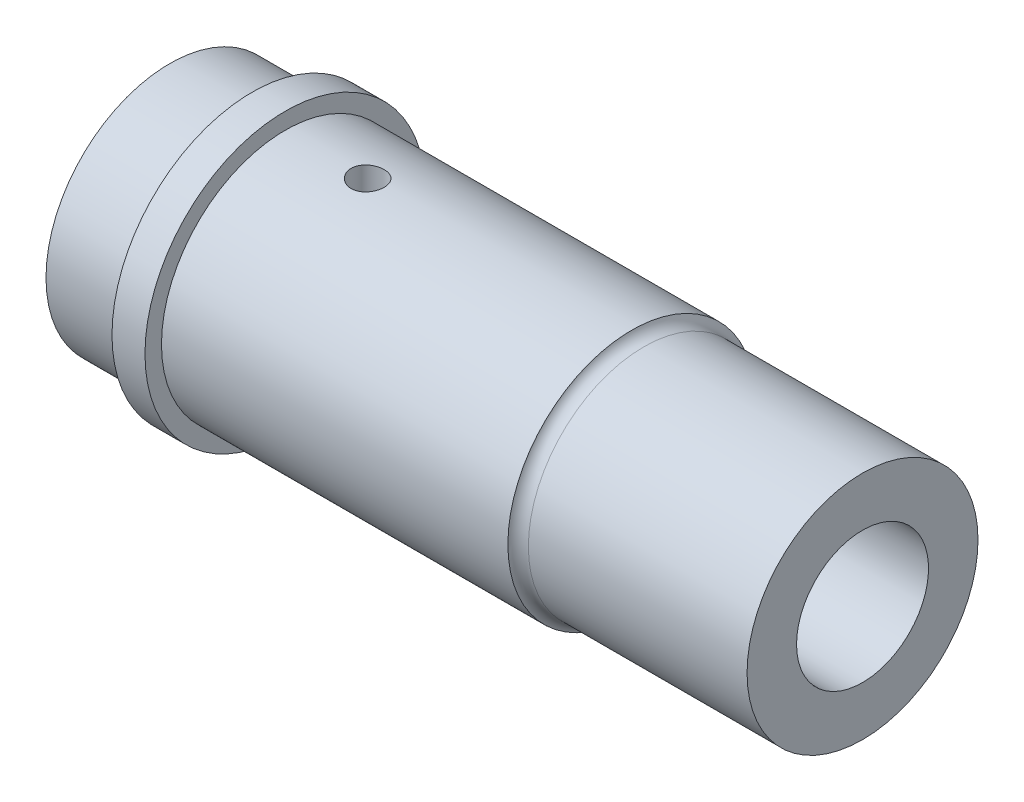
ISO-10303-21;
HEADER;
FILE_DESCRIPTION(('STEP AP214'),'2;1');
FILE_NAME('part.step','',(''),(''),'','','');
FILE_SCHEMA(('AUTOMOTIVE_DESIGN { 1 0 10303 214 1 1 1 1 }'));
ENDSEC;
DATA;
#1=APPLICATION_CONTEXT('core data for automotive mechanical design processes');
#2=APPLICATION_PROTOCOL_DEFINITION('international standard','automotive_design',2000,#1);
#3=PRODUCT_CONTEXT('',#1,'mechanical');
#4=PRODUCT('Part','Part','',(#3));
#5=PRODUCT_RELATED_PRODUCT_CATEGORY('part','',(#4));
#6=PRODUCT_DEFINITION_FORMATION('','',#4);
#7=PRODUCT_DEFINITION_CONTEXT('part definition',#1,'design');
#8=PRODUCT_DEFINITION('design','',#6,#7);
#9=PRODUCT_DEFINITION_SHAPE('','',#8);
#10=(LENGTH_UNIT() NAMED_UNIT(*) SI_UNIT(.MILLI.,.METRE.));
#11=(NAMED_UNIT(*) PLANE_ANGLE_UNIT() SI_UNIT($,.RADIAN.));
#12=(NAMED_UNIT(*) SI_UNIT($,.STERADIAN.) SOLID_ANGLE_UNIT());
#13=UNCERTAINTY_MEASURE_WITH_UNIT(LENGTH_MEASURE(1.E-05),#10,'distance_accuracy_value','');
#14=(GEOMETRIC_REPRESENTATION_CONTEXT(3) GLOBAL_UNCERTAINTY_ASSIGNED_CONTEXT((#13)) GLOBAL_UNIT_ASSIGNED_CONTEXT((#10,
#11,#12)) REPRESENTATION_CONTEXT('',''));
#15=CARTESIAN_POINT('',(0.,0.,0.));
#16=DIRECTION('',(0.,0.,1.));
#17=DIRECTION('',(1.,0.,0.));
#18=AXIS2_PLACEMENT_3D('',#15,#16,#17);
#19=CARTESIAN_POINT('',(42.,0.,0.));
#20=DIRECTION('',(-1.,0.,0.));
#21=DIRECTION('',(0.,0.,1.));
#22=AXIS2_PLACEMENT_3D('',#19,#20,#21);
#23=CYLINDRICAL_SURFACE('',#22,7.5);
#24=CARTESIAN_POINT('',(28.,0.,0.));
#25=DIRECTION('',(1.,0.,0.));
#26=DIRECTION('',(0.,0.,-1.));
#27=AXIS2_PLACEMENT_3D('',#24,#25,#26);
#28=CIRCLE('',#27,7.5);
#29=CARTESIAN_POINT('',(28.,0.,-7.5));
#30=VERTEX_POINT('',#29);
#31=EDGE_CURVE('E188',#30,#30,#28,.T.);
#32=ORIENTED_EDGE('',*,*,#31,.F.);
#33=EDGE_LOOP('',(#32));
#34=FACE_BOUND('',#33,.T.);
#35=CARTESIAN_POINT('',(12.,7.43303437365925,1.));
#36=CARTESIAN_POINT('',(12.0559019277301,7.43303522266631,0.99999764297421));
#37=CARTESIAN_POINT('',(12.1118380165464,7.43367182371829,0.995296633522847));
#38=CARTESIAN_POINT('',(12.222151231157,7.43614824351763,0.976618981332773));
#39=CARTESIAN_POINT('',(12.2765267024564,7.43798929330704,0.962632848245785));
#40=CARTESIAN_POINT('',(12.382105684117,7.44266246058434,0.925806555700512));
#41=CARTESIAN_POINT('',(12.4333114058099,7.4454938777722,0.902972651375005));
#42=CARTESIAN_POINT('',(12.5311555378537,7.45182791129731,0.849112824403647));
#43=CARTESIAN_POINT('',(12.5777946794687,7.45533041990363,0.818088216317403));
#44=CARTESIAN_POINT('',(12.6654867273345,7.46263688659337,0.74851685244753));
#45=CARTESIAN_POINT('',(12.7065064328398,7.4664424424659,0.709928411374281));
#46=CARTESIAN_POINT('',(12.7815081227281,7.47391188129393,0.626414614363067));
#47=CARTESIAN_POINT('',(12.8154897457381,7.47757575696696,0.581488933235995));
#48=CARTESIAN_POINT('',(12.8755709208582,7.48436549880109,0.486365862463802));
#49=CARTESIAN_POINT('',(12.9016402446451,7.48748928251119,0.43614921885561));
#50=CARTESIAN_POINT('',(12.9449630820904,7.49282926707925,0.332001908018684));
#51=CARTESIAN_POINT('',(12.9622169661888,7.49504550607303,0.2780713969612));
#52=CARTESIAN_POINT('',(12.9873194547901,7.49830943097799,0.168367687507043));
#53=CARTESIAN_POINT('',(12.995223407506,7.49936399102537,0.112607361734948));
#54=CARTESIAN_POINT('',(13.0015733043684,7.5002092398576,0.000542501151827599));
#55=CARTESIAN_POINT('',(13.0000196688683,7.49999998481415,-0.0557620093612336));
#56=CARTESIAN_POINT('',(12.9875426347295,7.49834672058453,-0.166940062232885));
#57=CARTESIAN_POINT('',(12.9766787676272,7.49691055668904,-0.221820418680892));
#58=CARTESIAN_POINT('',(12.9459828364892,7.49297362046144,-0.328972061356277));
#59=CARTESIAN_POINT('',(12.9261505824159,7.49047282557017,-0.38124329227092));
#60=CARTESIAN_POINT('',(12.8780182794391,7.48467409502082,-0.481875904212065));
#61=CARTESIAN_POINT('',(12.8496926884085,7.48137376072939,-0.53022492467663));
#62=CARTESIAN_POINT('',(12.7853963713586,7.4743447520952,-0.621505845367393));
#63=CARTESIAN_POINT('',(12.7494252466861,7.47061605542144,-0.664437462933408));
#64=CARTESIAN_POINT('',(12.6705260758205,7.46311294047831,-0.744015030772694));
#65=CARTESIAN_POINT('',(12.6275461159032,7.459338392122,-0.780609516765106));
#66=CARTESIAN_POINT('',(12.5360270343137,7.45219749384619,-0.846073465285956));
#67=CARTESIAN_POINT('',(12.4874878905985,7.44883114554537,-0.874942897181765));
#68=CARTESIAN_POINT('',(12.3861799998266,7.4428878816717,-0.9241414304325));
#69=CARTESIAN_POINT('',(12.3334090477408,7.44031138107393,-0.944466044533533));
#70=CARTESIAN_POINT('',(12.2251609896808,7.43624737732859,-0.97595045022462));
#71=CARTESIAN_POINT('',(12.1696840329867,7.43475981418081,-0.987110746770717));
#72=CARTESIAN_POINT('',(12.0580543324975,7.43305322505173,-0.999880803843635));
#73=CARTESIAN_POINT('',(12.0019100348337,7.43282455755814,-1.00156315549406));
#74=CARTESIAN_POINT('',(11.8901403719476,7.43363612148349,-0.995521440943979));
#75=CARTESIAN_POINT('',(11.8345149941303,7.43467632202375,-0.987797603648882));
#76=CARTESIAN_POINT('',(11.7255820067972,7.43789960218385,-0.963224025185097));
#77=CARTESIAN_POINT('',(11.6722662534909,7.44007823893825,-0.946409751616798));
#78=CARTESIAN_POINT('',(11.5692105432738,7.44532929507204,-0.904169225400625));
#79=CARTESIAN_POINT('',(11.5194707283381,7.44840174991421,-0.878742631046914));
#80=CARTESIAN_POINT('',(11.4246513447796,7.45511723309759,-0.819822032086053));
#81=CARTESIAN_POINT('',(11.3796014758159,7.45876356894567,-0.7862806158315));
#82=CARTESIAN_POINT('',(11.2957445307815,7.46620571758255,-0.712149161563993));
#83=CARTESIAN_POINT('',(11.256937731926,7.47000153699967,-0.671558810718769));
#84=CARTESIAN_POINT('',(11.1864117230394,7.47734474327666,-0.584163774179119));
#85=CARTESIAN_POINT('',(11.1547403418142,7.48089035024858,-0.537320320466262));
#86=CARTESIAN_POINT('',(11.0997158589123,7.48730670739152,-0.43893622615881));
#87=CARTESIAN_POINT('',(11.0763625701219,7.49017747274246,-0.38739569125685));
#88=CARTESIAN_POINT('',(11.0387153692059,7.49491282345577,-0.281236386261717));
#89=CARTESIAN_POINT('',(11.0243942854582,7.49678042410392,-0.226627392123681));
#90=CARTESIAN_POINT('',(11.0051297572695,7.49931158343309,-0.115753246711599));
#91=CARTESIAN_POINT('',(11.0001858286461,7.49997520428063,-0.0594881810999117));
#92=CARTESIAN_POINT('',(10.9998258663798,7.50002323624209,0.0526349368557948));
#93=CARTESIAN_POINT('',(11.0043362647028,7.49941752456714,0.108492762960941));
#94=CARTESIAN_POINT('',(11.022600520616,7.4970146660993,0.218648721526177));
#95=CARTESIAN_POINT('',(11.0363543652607,7.49521752097504,0.272946856170524));
#96=CARTESIAN_POINT('',(11.0726910235383,7.49063278321235,0.37842911729443));
#97=CARTESIAN_POINT('',(11.095269813204,7.48784564204157,0.429614650771956));
#98=CARTESIAN_POINT('',(11.1486077748229,7.48158874697992,0.527482039315438));
#99=CARTESIAN_POINT('',(11.1793670978262,7.47811898048495,0.574163811199582));
#100=CARTESIAN_POINT('',(11.2484633410018,7.47085145604927,0.662073643033369));
#101=CARTESIAN_POINT('',(11.2868548950696,7.46705145149955,0.703258578582));
#102=CARTESIAN_POINT('',(11.3700115345237,7.45956932448384,0.778629477936081));
#103=CARTESIAN_POINT('',(11.4147781219606,7.45588723005032,0.812813787651156));
#104=CARTESIAN_POINT('',(11.5096419707854,7.4490405494253,0.873343954892478));
#105=CARTESIAN_POINT('',(11.559761795755,7.44587830880396,0.89965470214564));
#106=CARTESIAN_POINT('',(11.6637242337586,7.4404568329187,0.943447591407442));
#107=CARTESIAN_POINT('',(11.7175627848798,7.43819663011144,0.960939198331794));
#108=CARTESIAN_POINT('',(11.8097241393627,7.43537566912471,0.982477401892938));
#109=CARTESIAN_POINT('',(11.8474691364837,7.4345021431111,0.989038740679089));
#110=CARTESIAN_POINT('',(11.9234707547356,7.43333120737231,0.997800826715829));
#111=CARTESIAN_POINT('',(11.9617273711999,7.43303379239608,1.00000161371131));
#112=CARTESIAN_POINT('',(12.,7.43303437365925,1.));
#113=B_SPLINE_CURVE_WITH_KNOTS('',3,(#35,#36,#37,#38,#39,#40,#41,#42,#43,#44,#45,#46,#47,#48,
#49,#50,#51,#52,#53,#54,#55,#56,#57,#58,#59,#60,#61,#62,#63,#64,#65,#66,#67,#68,#69,#70,#71,#72,
#73,#74,#75,#76,#77,#78,#79,#80,#81,#82,#83,#84,#85,#86,#87,#88,#89,#90,#91,#92,#93,#94,#95,#96,
#97,#98,#99,#100,#101,#102,#103,#104,#105,#106,#107,#108,#109,#110,#111,#112),.UNSPECIFIED.,.T.,
.F.,(4,2,2,2,2,2,2,2,2,2,2,2,2,2,2,2,2,2,2,2,2,2,2,2,2,2,2,2,2,2,2,2,2,2,2,2,2,2,4),(0.,
0.16756594461955,0.335303423041822,0.502922531373104,0.67051475416376,0.839057975594805,
1.00760984880017,1.17679778261471,1.34597860627362,1.51415284761382,1.68231961431326,
1.84941904333874,2.01652201332237,2.18413264227024,2.35175201291212,2.52067457533377,
2.68959780758443,2.85860963826768,3.02761215573449,3.19531851289863,3.36302078890669,
3.53007342408195,3.69713268808003,3.86519264070064,4.03326005374208,4.2024225588115,
4.37158125836474,4.54022861884065,4.70886727109971,4.87619854927048,5.04352959309218,
5.21078442673995,5.37804234889437,5.54654371183369,5.71508484203598,5.88436670989948,
6.05346651155517,6.16818970471025,6.28291185219902),.UNSPECIFIED.);
#114=CARTESIAN_POINT('',(12.,7.43303437365925,1.));
#115=VERTEX_POINT('',#114);
#116=EDGE_CURVE('E192',#115,#115,#113,.T.);
#117=ORIENTED_EDGE('',*,*,#116,.F.);
#118=EDGE_LOOP('',(#117));
#119=FACE_BOUND('',#118,.T.);
#120=CARTESIAN_POINT('',(7.,0.,0.));
#121=DIRECTION('',(1.,0.,0.));
#122=DIRECTION('',(0.,0.,-1.));
#123=AXIS2_PLACEMENT_3D('',#120,#121,#122);
#124=CIRCLE('',#123,7.5);
#125=CARTESIAN_POINT('',(7.,0.,-7.5));
#126=VERTEX_POINT('',#125);
#127=EDGE_CURVE('E252',#126,#126,#124,.T.);
#128=ORIENTED_EDGE('',*,*,#127,.T.);
#129=EDGE_LOOP('',(#128));
#130=FACE_BOUND('',#129,.T.);
#131=CARTESIAN_POINT('',(27.,0.,0.));
#132=DIRECTION('',(-1.,0.,0.));
#133=DIRECTION('',(0.,0.,1.));
#134=AXIS2_PLACEMENT_3D('',#131,#132,#133);
#135=CIRCLE('',#134,7.5);
#136=CARTESIAN_POINT('',(27.,-7.07106781186548,-2.5));
#137=VERTEX_POINT('',#136);
#138=CARTESIAN_POINT('',(27.,-7.07106781186547,2.5));
#139=VERTEX_POINT('',#138);
#140=EDGE_CURVE('E13',#137,#139,#135,.T.);
#141=ORIENTED_EDGE('',*,*,#140,.F.);
#142=DIRECTION('',(-1.,0.,0.));
#143=VECTOR('',#142,1.);
#144=CARTESIAN_POINT('',(42.,-7.07106781186548,-2.5));
#145=LINE('',#144,#143);
#146=CARTESIAN_POINT('',(8.5,-7.07106781186548,-2.5));
#147=VERTEX_POINT('',#146);
#148=EDGE_CURVE('E56',#137,#147,#145,.T.);
#149=ORIENTED_EDGE('',*,*,#148,.T.);
#150=CARTESIAN_POINT('',(8.5,0.,0.));
#151=DIRECTION('',(1.,0.,0.));
#152=DIRECTION('',(0.,0.,-1.));
#153=AXIS2_PLACEMENT_3D('',#150,#151,#152);
#154=CIRCLE('',#153,7.5);
#155=CARTESIAN_POINT('',(8.5,-7.07106781186547,2.5));
#156=VERTEX_POINT('',#155);
#157=EDGE_CURVE('E279',#156,#147,#154,.T.);
#158=ORIENTED_EDGE('',*,*,#157,.F.);
#159=DIRECTION('',(-1.,0.,0.));
#160=VECTOR('',#159,1.);
#161=CARTESIAN_POINT('',(42.,-7.07106781186547,2.5));
#162=LINE('',#161,#160);
#163=EDGE_CURVE('E282',#156,#139,#162,.F.);
#164=ORIENTED_EDGE('',*,*,#163,.T.);
#165=EDGE_LOOP('',(#141,#149,#158,#164));
#166=FACE_BOUND('',#165,.T.);
#167=ADVANCED_FACE('F48',(#34,#119,#130,#166),#23,.T.);
#168=CARTESIAN_POINT('',(42.,0.,0.));
#169=DIRECTION('',(1.,0.,0.));
#170=DIRECTION('',(0.,0.,-1.));
#171=AXIS2_PLACEMENT_3D('',#168,#169,#170);
#172=PLANE('',#171);
#173=CARTESIAN_POINT('',(42.,0.,0.));
#174=DIRECTION('',(-1.,0.,0.));
#175=DIRECTION('',(0.,0.,1.));
#176=AXIS2_PLACEMENT_3D('',#173,#174,#175);
#177=CIRCLE('',#176,4.);
#178=CARTESIAN_POINT('',(42.,0.,4.));
#179=VERTEX_POINT('',#178);
#180=EDGE_CURVE('E202',#179,#179,#177,.T.);
#181=ORIENTED_EDGE('',*,*,#180,.T.);
#182=EDGE_LOOP('',(#181));
#183=FACE_BOUND('',#182,.T.);
#184=CARTESIAN_POINT('',(42.,0.,0.));
#185=DIRECTION('',(1.,0.,0.));
#186=DIRECTION('',(0.,0.,-1.));
#187=AXIS2_PLACEMENT_3D('',#184,#185,#186);
#188=CIRCLE('',#187,7.);
#189=CARTESIAN_POINT('',(42.,0.,-7.));
#190=VERTEX_POINT('',#189);
#191=EDGE_CURVE('E184',#190,#190,#188,.T.);
#192=ORIENTED_EDGE('',*,*,#191,.T.);
#193=EDGE_LOOP('',(#192));
#194=FACE_BOUND('',#193,.T.);
#195=ADVANCED_FACE('F214',(#183,#194),#172,.T.);
#196=CARTESIAN_POINT('',(5.,0.,0.));
#197=DIRECTION('',(-1.,0.,0.));
#198=DIRECTION('',(0.,0.,1.));
#199=AXIS2_PLACEMENT_3D('',#196,#197,#198);
#200=CYLINDRICAL_SURFACE('',#199,7.5);
#201=CARTESIAN_POINT('',(5.,0.,0.));
#202=DIRECTION('',(1.,0.,0.));
#203=DIRECTION('',(0.,0.,-1.));
#204=AXIS2_PLACEMENT_3D('',#201,#202,#203);
#205=CIRCLE('',#204,7.5);
#206=CARTESIAN_POINT('',(5.,0.,-7.5));
#207=VERTEX_POINT('',#206);
#208=EDGE_CURVE('E243',#207,#207,#205,.T.);
#209=ORIENTED_EDGE('',*,*,#208,.F.);
#210=EDGE_LOOP('',(#209));
#211=FACE_BOUND('',#210,.T.);
#212=CARTESIAN_POINT('',(0.,0.,0.));
#213=DIRECTION('',(1.,0.,0.));
#214=DIRECTION('',(0.,0.,-1.));
#215=AXIS2_PLACEMENT_3D('',#212,#213,#214);
#216=CIRCLE('',#215,7.5);
#217=CARTESIAN_POINT('',(0.,0.,-7.5));
#218=VERTEX_POINT('',#217);
#219=EDGE_CURVE('E246',#218,#218,#216,.T.);
#220=ORIENTED_EDGE('',*,*,#219,.T.);
#221=EDGE_LOOP('',(#220));
#222=FACE_BOUND('',#221,.T.);
#223=ADVANCED_FACE('F217',(#211,#222),#200,.T.);
#224=CARTESIAN_POINT('',(0.,0.,0.));
#225=DIRECTION('',(1.,0.,0.));
#226=DIRECTION('',(0.,0.,-1.));
#227=AXIS2_PLACEMENT_3D('',#224,#225,#226);
#228=PLANE('',#227);
#229=DIRECTION('',(0.,0.,-1.));
#230=VECTOR('',#229,1.);
#231=CARTESIAN_POINT('',(0.,5.5,-1.5));
#232=LINE('',#231,#230);
#233=CARTESIAN_POINT('',(0.,5.5,1.5));
#234=VERTEX_POINT('',#233);
#235=CARTESIAN_POINT('',(0.,5.5,-1.5));
#236=VERTEX_POINT('',#235);
#237=EDGE_CURVE('E171',#234,#236,#232,.T.);
#238=ORIENTED_EDGE('',*,*,#237,.F.);
#239=DIRECTION('',(0.,1.,0.));
#240=VECTOR('',#239,1.);
#241=CARTESIAN_POINT('',(0.,2.5,1.5));
#242=LINE('',#241,#240);
#243=CARTESIAN_POINT('',(0.,3.70809924354783,1.5));
#244=VERTEX_POINT('',#243);
#245=EDGE_CURVE('E157',#244,#234,#242,.T.);
#246=ORIENTED_EDGE('',*,*,#245,.F.);
#247=CARTESIAN_POINT('',(0.,0.,0.));
#248=DIRECTION('',(-1.,0.,0.));
#249=DIRECTION('',(0.,0.,1.));
#250=AXIS2_PLACEMENT_3D('',#247,#248,#249);
#251=CIRCLE('',#250,4.);
#252=CARTESIAN_POINT('',(0.,3.70809924354783,-1.5));
#253=VERTEX_POINT('',#252);
#254=EDGE_CURVE('E201',#253,#244,#251,.T.);
#255=ORIENTED_EDGE('',*,*,#254,.F.);
#256=DIRECTION('',(0.,-1.,0.));
#257=VECTOR('',#256,1.);
#258=CARTESIAN_POINT('',(0.,2.5,-1.5));
#259=LINE('',#258,#257);
#260=EDGE_CURVE('E163',#236,#253,#259,.T.);
#261=ORIENTED_EDGE('',*,*,#260,.F.);
#262=EDGE_LOOP('',(#238,#246,#255,#261));
#263=FACE_BOUND('',#262,.T.);
#264=ORIENTED_EDGE('',*,*,#219,.F.);
#265=EDGE_LOOP('',(#264));
#266=FACE_BOUND('',#265,.T.);
#267=ADVANCED_FACE('F232',(#263,#266),#228,.F.);
#268=CARTESIAN_POINT('',(7.,0.,0.));
#269=DIRECTION('',(-1.,0.,0.));
#270=DIRECTION('',(0.,0.,1.));
#271=AXIS2_PLACEMENT_3D('',#268,#269,#270);
#272=CYLINDRICAL_SURFACE('',#271,8.5);
#273=CARTESIAN_POINT('',(7.,0.,0.));
#274=DIRECTION('',(1.,0.,0.));
#275=DIRECTION('',(0.,0.,-1.));
#276=AXIS2_PLACEMENT_3D('',#273,#274,#275);
#277=CIRCLE('',#276,8.5);
#278=CARTESIAN_POINT('',(7.,0.,-8.5));
#279=VERTEX_POINT('',#278);
#280=EDGE_CURVE('E249',#279,#279,#277,.T.);
#281=ORIENTED_EDGE('',*,*,#280,.F.);
#282=EDGE_LOOP('',(#281));
#283=FACE_BOUND('',#282,.T.);
#284=CARTESIAN_POINT('',(5.,0.,0.));
#285=DIRECTION('',(1.,0.,0.));
#286=DIRECTION('',(0.,0.,-1.));
#287=AXIS2_PLACEMENT_3D('',#284,#285,#286);
#288=CIRCLE('',#287,8.5);
#289=CARTESIAN_POINT('',(5.,0.,-8.5));
#290=VERTEX_POINT('',#289);
#291=EDGE_CURVE('E256',#290,#290,#288,.T.);
#292=ORIENTED_EDGE('',*,*,#291,.T.);
#293=EDGE_LOOP('',(#292));
#294=FACE_BOUND('',#293,.T.);
#295=ADVANCED_FACE('F225',(#283,#294),#272,.T.);
#296=CARTESIAN_POINT('',(7.,0.,0.));
#297=DIRECTION('',(1.,0.,0.));
#298=DIRECTION('',(0.,0.,-1.));
#299=AXIS2_PLACEMENT_3D('',#296,#297,#298);
#300=PLANE('',#299);
#301=ORIENTED_EDGE('',*,*,#127,.F.);
#302=EDGE_LOOP('',(#301));
#303=FACE_BOUND('',#302,.T.);
#304=ORIENTED_EDGE('',*,*,#280,.T.);
#305=EDGE_LOOP('',(#304));
#306=FACE_BOUND('',#305,.T.);
#307=ADVANCED_FACE('F222',(#303,#306),#300,.T.);
#308=CARTESIAN_POINT('',(5.,0.,0.));
#309=DIRECTION('',(1.,0.,0.));
#310=DIRECTION('',(0.,0.,-1.));
#311=AXIS2_PLACEMENT_3D('',#308,#309,#310);
#312=PLANE('',#311);
#313=ORIENTED_EDGE('',*,*,#208,.T.);
#314=EDGE_LOOP('',(#313));
#315=FACE_BOUND('',#314,.T.);
#316=ORIENTED_EDGE('',*,*,#291,.F.);
#317=EDGE_LOOP('',(#316));
#318=FACE_BOUND('',#317,.T.);
#319=ADVANCED_FACE('F212',(#315,#318),#312,.F.);
#320=CARTESIAN_POINT('',(42.,0.,0.));
#321=DIRECTION('',(-1.,0.,0.));
#322=DIRECTION('',(0.,0.,1.));
#323=AXIS2_PLACEMENT_3D('',#320,#321,#322);
#324=CYLINDRICAL_SURFACE('',#323,4.);
#325=ORIENTED_EDGE('',*,*,#254,.T.);
#326=DIRECTION('',(-1.,0.,0.));
#327=VECTOR('',#326,1.);
#328=CARTESIAN_POINT('',(42.,3.70809924354783,1.5));
#329=LINE('',#328,#327);
#330=CARTESIAN_POINT('',(28.,3.70809924354783,1.5));
#331=VERTEX_POINT('',#330);
#332=EDGE_CURVE('E275',#244,#331,#329,.F.);
#333=ORIENTED_EDGE('',*,*,#332,.T.);
#334=CARTESIAN_POINT('',(28.,0.,0.));
#335=DIRECTION('',(1.,0.,0.));
#336=DIRECTION('',(0.,0.,-1.));
#337=AXIS2_PLACEMENT_3D('',#334,#335,#336);
#338=CIRCLE('',#337,4.);
#339=CARTESIAN_POINT('',(28.,3.70809924354783,-1.5));
#340=VERTEX_POINT('',#339);
#341=EDGE_CURVE('E264',#331,#340,#338,.F.);
#342=ORIENTED_EDGE('',*,*,#341,.T.);
#343=DIRECTION('',(-1.,0.,0.));
#344=VECTOR('',#343,1.);
#345=CARTESIAN_POINT('',(42.,3.70809924354783,-1.5));
#346=LINE('',#345,#344);
#347=EDGE_CURVE('E271',#340,#253,#346,.T.);
#348=ORIENTED_EDGE('',*,*,#347,.T.);
#349=EDGE_LOOP('',(#325,#333,#342,#348));
#350=FACE_BOUND('',#349,.T.);
#351=ORIENTED_EDGE('',*,*,#180,.F.);
#352=EDGE_LOOP('',(#351));
#353=FACE_BOUND('',#352,.T.);
#354=ADVANCED_FACE('F209',(#350,#353),#324,.F.);
#355=CARTESIAN_POINT('',(12.,-8.501,0.));
#356=DIRECTION('',(0.,1.,0.));
#357=DIRECTION('',(0.,0.,1.));
#358=AXIS2_PLACEMENT_3D('',#355,#356,#357);
#359=CYLINDRICAL_SURFACE('',#358,1.);
#360=CARTESIAN_POINT('',(12.,5.5,0.));
#361=DIRECTION('',(0.,1.,0.));
#362=DIRECTION('',(0.,0.,1.));
#363=AXIS2_PLACEMENT_3D('',#360,#361,#362);
#364=CIRCLE('',#363,1.);
#365=CARTESIAN_POINT('',(12.,5.5,1.));
#366=VERTEX_POINT('',#365);
#367=EDGE_CURVE('E180',#366,#366,#364,.F.);
#368=ORIENTED_EDGE('',*,*,#367,.T.);
#369=EDGE_LOOP('',(#368));
#370=FACE_BOUND('',#369,.T.);
#371=ORIENTED_EDGE('',*,*,#116,.T.);
#372=EDGE_LOOP('',(#371));
#373=FACE_BOUND('',#372,.T.);
#374=ADVANCED_FACE('F204',(#370,#373),#359,.F.);
#375=CARTESIAN_POINT('',(28.,0.,0.));
#376=DIRECTION('',(1.,0.,0.));
#377=DIRECTION('',(0.,0.,-1.));
#378=AXIS2_PLACEMENT_3D('',#375,#376,#377);
#379=CYLINDRICAL_SURFACE('',#378,7.);
#380=CARTESIAN_POINT('',(28.7416198487096,0.,0.));
#381=DIRECTION('',(-1.,0.,0.));
#382=DIRECTION('',(0.,0.,1.));
#383=AXIS2_PLACEMENT_3D('',#380,#381,#382);
#384=CIRCLE('',#383,7.);
#385=CARTESIAN_POINT('',(28.7416198487096,0.,7.));
#386=VERTEX_POINT('',#385);
#387=EDGE_CURVE('E260',#386,#386,#384,.F.);
#388=ORIENTED_EDGE('',*,*,#387,.T.);
#389=EDGE_LOOP('',(#388));
#390=FACE_BOUND('',#389,.T.);
#391=ORIENTED_EDGE('',*,*,#191,.F.);
#392=EDGE_LOOP('',(#391));
#393=FACE_BOUND('',#392,.T.);
#394=ADVANCED_FACE('F310',(#390,#393),#379,.T.);
#395=CARTESIAN_POINT('',(28.7416198487096,0.,0.));
#396=DIRECTION('',(-1.,0.,0.));
#397=DIRECTION('',(0.,0.,1.));
#398=AXIS2_PLACEMENT_3D('',#395,#396,#397);
#399=TOROIDAL_SURFACE('',#398,7.8,0.8);
#400=ORIENTED_EDGE('',*,*,#31,.T.);
#401=EDGE_LOOP('',(#400));
#402=FACE_BOUND('',#401,.T.);
#403=ORIENTED_EDGE('',*,*,#387,.F.);
#404=EDGE_LOOP('',(#403));
#405=FACE_BOUND('',#404,.T.);
#406=ADVANCED_FACE('F50',(#402,#405),#399,.F.);
#407=CARTESIAN_POINT('',(28.,2.5,1.5));
#408=DIRECTION('',(0.,0.,1.));
#409=DIRECTION('',(1.,0.,0.));
#410=AXIS2_PLACEMENT_3D('',#407,#408,#409);
#411=PLANE('',#410);
#412=ORIENTED_EDGE('',*,*,#245,.T.);
#413=DIRECTION('',(-1.,0.,0.));
#414=VECTOR('',#413,1.);
#415=CARTESIAN_POINT('',(28.,5.5,1.5));
#416=LINE('',#415,#414);
#417=CARTESIAN_POINT('',(28.,5.5,1.5));
#418=VERTEX_POINT('',#417);
#419=EDGE_CURVE('E168',#418,#234,#416,.T.);
#420=ORIENTED_EDGE('',*,*,#419,.F.);
#421=DIRECTION('',(0.,1.,0.));
#422=VECTOR('',#421,1.);
#423=CARTESIAN_POINT('',(28.,2.5,1.5));
#424=LINE('',#423,#422);
#425=EDGE_CURVE('E159',#331,#418,#424,.T.);
#426=ORIENTED_EDGE('',*,*,#425,.F.);
#427=ORIENTED_EDGE('',*,*,#332,.F.);
#428=EDGE_LOOP('',(#412,#420,#426,#427));
#429=FACE_BOUND('',#428,.T.);
#430=ADVANCED_FACE('F317',(#429),#411,.F.);
#431=CARTESIAN_POINT('',(28.,2.5,-1.5));
#432=DIRECTION('',(0.,0.,-1.));
#433=DIRECTION('',(-1.,0.,0.));
#434=AXIS2_PLACEMENT_3D('',#431,#432,#433);
#435=PLANE('',#434);
#436=DIRECTION('',(0.,-1.,0.));
#437=VECTOR('',#436,1.);
#438=CARTESIAN_POINT('',(28.,2.5,-1.5));
#439=LINE('',#438,#437);
#440=CARTESIAN_POINT('',(28.,5.5,-1.5));
#441=VERTEX_POINT('',#440);
#442=EDGE_CURVE('E77',#441,#340,#439,.T.);
#443=ORIENTED_EDGE('',*,*,#442,.F.);
#444=DIRECTION('',(-1.,0.,0.));
#445=VECTOR('',#444,1.);
#446=CARTESIAN_POINT('',(28.,5.5,-1.5));
#447=LINE('',#446,#445);
#448=EDGE_CURVE('E177',#441,#236,#447,.T.);
#449=ORIENTED_EDGE('',*,*,#448,.T.);
#450=ORIENTED_EDGE('',*,*,#260,.T.);
#451=ORIENTED_EDGE('',*,*,#347,.F.);
#452=EDGE_LOOP('',(#443,#449,#450,#451));
#453=FACE_BOUND('',#452,.T.);
#454=ADVANCED_FACE('F323',(#453),#435,.F.);
#455=CARTESIAN_POINT('',(28.,0.,0.));
#456=DIRECTION('',(1.,0.,0.));
#457=DIRECTION('',(0.,0.,-1.));
#458=AXIS2_PLACEMENT_3D('',#455,#456,#457);
#459=PLANE('',#458);
#460=ORIENTED_EDGE('',*,*,#425,.T.);
#461=DIRECTION('',(0.,0.,-1.));
#462=VECTOR('',#461,1.);
#463=CARTESIAN_POINT('',(28.,5.5,-1.5));
#464=LINE('',#463,#462);
#465=EDGE_CURVE('E162',#418,#441,#464,.T.);
#466=ORIENTED_EDGE('',*,*,#465,.T.);
#467=ORIENTED_EDGE('',*,*,#442,.T.);
#468=ORIENTED_EDGE('',*,*,#341,.F.);
#469=EDGE_LOOP('',(#460,#466,#467,#468));
#470=FACE_BOUND('',#469,.T.);
#471=ADVANCED_FACE('F328',(#470),#459,.F.);
#472=CARTESIAN_POINT('',(28.,5.5,-1.5));
#473=DIRECTION('',(0.,1.,0.));
#474=DIRECTION('',(0.,0.,1.));
#475=AXIS2_PLACEMENT_3D('',#472,#473,#474);
#476=PLANE('',#475);
#477=ORIENTED_EDGE('',*,*,#237,.T.);
#478=ORIENTED_EDGE('',*,*,#448,.F.);
#479=ORIENTED_EDGE('',*,*,#465,.F.);
#480=ORIENTED_EDGE('',*,*,#419,.T.);
#481=EDGE_LOOP('',(#477,#478,#479,#480));
#482=FACE_BOUND('',#481,.T.);
#483=ORIENTED_EDGE('',*,*,#367,.F.);
#484=EDGE_LOOP('',(#483));
#485=FACE_BOUND('',#484,.T.);
#486=ADVANCED_FACE('F325',(#482,#485),#476,.F.);
#487=CARTESIAN_POINT('',(-0.0710678118654787,-10.,-2.5));
#488=DIRECTION('',(0.,0.,-1.));
#489=DIRECTION('',(-1.,0.,0.));
#490=AXIS2_PLACEMENT_3D('',#487,#488,#489);
#491=PLANE('',#490);
#492=DIRECTION('',(0.,1.,0.));
#493=VECTOR('',#492,1.);
#494=CARTESIAN_POINT('',(27.,-10.,-2.5));
#495=LINE('',#494,#493);
#496=CARTESIAN_POINT('',(27.,-5.,-2.5));
#497=VERTEX_POINT('',#496);
#498=EDGE_CURVE('E125',#137,#497,#495,.T.);
#499=ORIENTED_EDGE('',*,*,#498,.T.);
#500=DIRECTION('',(1.,0.,0.));
#501=VECTOR('',#500,1.);
#502=CARTESIAN_POINT('',(-0.0710678118654787,-5.,-2.5));
#503=LINE('',#502,#501);
#504=CARTESIAN_POINT('',(8.5,-5.,-2.5));
#505=VERTEX_POINT('',#504);
#506=EDGE_CURVE('E129',#505,#497,#503,.T.);
#507=ORIENTED_EDGE('',*,*,#506,.F.);
#508=DIRECTION('',(0.,-1.,0.));
#509=VECTOR('',#508,1.);
#510=CARTESIAN_POINT('',(8.5,-10.,-2.5));
#511=LINE('',#510,#509);
#512=EDGE_CURVE('E158',#505,#147,#511,.T.);
#513=ORIENTED_EDGE('',*,*,#512,.T.);
#514=ORIENTED_EDGE('',*,*,#148,.F.);
#515=EDGE_LOOP('',(#499,#507,#513,#514));
#516=FACE_BOUND('',#515,.T.);
#517=ADVANCED_FACE('F127',(#516),#491,.F.);
#518=CARTESIAN_POINT('',(-0.0710678118654787,-10.,2.5));
#519=DIRECTION('',(0.,0.,1.));
#520=DIRECTION('',(1.,0.,0.));
#521=AXIS2_PLACEMENT_3D('',#518,#519,#520);
#522=PLANE('',#521);
#523=DIRECTION('',(0.,1.,0.));
#524=VECTOR('',#523,1.);
#525=CARTESIAN_POINT('',(8.5,-10.,2.5));
#526=LINE('',#525,#524);
#527=CARTESIAN_POINT('',(8.5,-5.,2.5));
#528=VERTEX_POINT('',#527);
#529=EDGE_CURVE('E66',#156,#528,#526,.T.);
#530=ORIENTED_EDGE('',*,*,#529,.T.);
#531=DIRECTION('',(1.,0.,0.));
#532=VECTOR('',#531,1.);
#533=CARTESIAN_POINT('',(-0.0710678118654787,-5.,2.5));
#534=LINE('',#533,#532);
#535=CARTESIAN_POINT('',(27.,-5.,2.5));
#536=VERTEX_POINT('',#535);
#537=EDGE_CURVE('E143',#528,#536,#534,.T.);
#538=ORIENTED_EDGE('',*,*,#537,.T.);
#539=DIRECTION('',(0.,-1.,0.));
#540=VECTOR('',#539,1.);
#541=CARTESIAN_POINT('',(27.,-10.,2.5));
#542=LINE('',#541,#540);
#543=EDGE_CURVE('E144',#536,#139,#542,.T.);
#544=ORIENTED_EDGE('',*,*,#543,.T.);
#545=ORIENTED_EDGE('',*,*,#163,.F.);
#546=EDGE_LOOP('',(#530,#538,#544,#545));
#547=FACE_BOUND('',#546,.T.);
#548=ADVANCED_FACE('F289',(#547),#522,.F.);
#549=CARTESIAN_POINT('',(27.,0.,0.));
#550=DIRECTION('',(-1.,0.,0.));
#551=DIRECTION('',(0.,0.,1.));
#552=AXIS2_PLACEMENT_3D('',#549,#550,#551);
#553=PLANE('',#552);
#554=ORIENTED_EDGE('',*,*,#140,.T.);
#555=ORIENTED_EDGE('',*,*,#543,.F.);
#556=DIRECTION('',(0.,0.,1.));
#557=VECTOR('',#556,1.);
#558=CARTESIAN_POINT('',(27.,-5.,2.5));
#559=LINE('',#558,#557);
#560=EDGE_CURVE('E134',#497,#536,#559,.T.);
#561=ORIENTED_EDGE('',*,*,#560,.F.);
#562=ORIENTED_EDGE('',*,*,#498,.F.);
#563=EDGE_LOOP('',(#554,#555,#561,#562));
#564=FACE_BOUND('',#563,.T.);
#565=ADVANCED_FACE('F147',(#564),#553,.T.);
#566=CARTESIAN_POINT('',(8.5,0.,0.));
#567=DIRECTION('',(1.,0.,0.));
#568=DIRECTION('',(0.,0.,-1.));
#569=AXIS2_PLACEMENT_3D('',#566,#567,#568);
#570=PLANE('',#569);
#571=ORIENTED_EDGE('',*,*,#157,.T.);
#572=ORIENTED_EDGE('',*,*,#512,.F.);
#573=DIRECTION('',(0.,0.,-1.));
#574=VECTOR('',#573,1.);
#575=CARTESIAN_POINT('',(8.5,-5.,2.5));
#576=LINE('',#575,#574);
#577=EDGE_CURVE('E140',#528,#505,#576,.T.);
#578=ORIENTED_EDGE('',*,*,#577,.F.);
#579=ORIENTED_EDGE('',*,*,#529,.F.);
#580=EDGE_LOOP('',(#571,#572,#578,#579));
#581=FACE_BOUND('',#580,.T.);
#582=ADVANCED_FACE('F290',(#581),#570,.T.);
#583=CARTESIAN_POINT('',(-0.0710678118654787,-5.,2.5));
#584=DIRECTION('',(0.,1.,0.));
#585=DIRECTION('',(0.,0.,1.));
#586=AXIS2_PLACEMENT_3D('',#583,#584,#585);
#587=PLANE('',#586);
#588=ORIENTED_EDGE('',*,*,#577,.T.);
#589=ORIENTED_EDGE('',*,*,#506,.T.);
#590=ORIENTED_EDGE('',*,*,#560,.T.);
#591=ORIENTED_EDGE('',*,*,#537,.F.);
#592=EDGE_LOOP('',(#588,#589,#590,#591));
#593=FACE_BOUND('',#592,.T.);
#594=ADVANCED_FACE('F138',(#593),#587,.F.);
#595=CLOSED_SHELL('',(#167,#195,#223,#267,#295,#307,#319,#354,#374,#394,#406,#430,#454,#471,
#486,#517,#548,#565,#582,#594));
#596=MANIFOLD_SOLID_BREP('B2',#595);
#597=ADVANCED_BREP_SHAPE_REPRESENTATION('',(#18,#596),#14);
#598=SHAPE_DEFINITION_REPRESENTATION(#9,#597);
ENDSEC;
END-ISO-10303-21;
